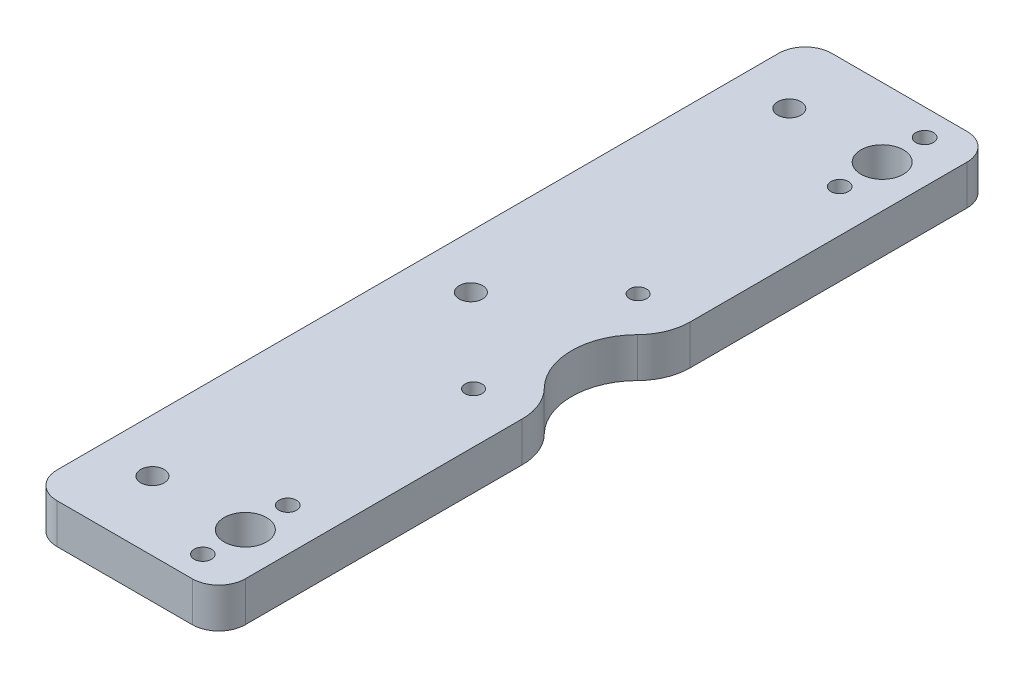
ISO-10303-21;
HEADER;
FILE_DESCRIPTION(('STEP AP214'),'2;1');
FILE_NAME('part.step','',(''),(''),'','','');
FILE_SCHEMA(('AUTOMOTIVE_DESIGN { 1 0 10303 214 1 1 1 1 }'));
ENDSEC;
DATA;
#1=APPLICATION_CONTEXT('core data for automotive mechanical design processes');
#2=APPLICATION_PROTOCOL_DEFINITION('international standard','automotive_design',2000,#1);
#3=PRODUCT_CONTEXT('',#1,'mechanical');
#4=PRODUCT('Part','Part','',(#3));
#5=PRODUCT_RELATED_PRODUCT_CATEGORY('part','',(#4));
#6=PRODUCT_DEFINITION_FORMATION('','',#4);
#7=PRODUCT_DEFINITION_CONTEXT('part definition',#1,'design');
#8=PRODUCT_DEFINITION('design','',#6,#7);
#9=PRODUCT_DEFINITION_SHAPE('','',#8);
#10=(LENGTH_UNIT() NAMED_UNIT(*) SI_UNIT(.MILLI.,.METRE.));
#11=(NAMED_UNIT(*) PLANE_ANGLE_UNIT() SI_UNIT($,.RADIAN.));
#12=(NAMED_UNIT(*) SI_UNIT($,.STERADIAN.) SOLID_ANGLE_UNIT());
#13=UNCERTAINTY_MEASURE_WITH_UNIT(LENGTH_MEASURE(1.E-05),#10,'distance_accuracy_value','');
#14=(GEOMETRIC_REPRESENTATION_CONTEXT(3) GLOBAL_UNCERTAINTY_ASSIGNED_CONTEXT((#13)) GLOBAL_UNIT_ASSIGNED_CONTEXT((#10,
#11,#12)) REPRESENTATION_CONTEXT('',''));
#15=CARTESIAN_POINT('',(0.,0.,0.));
#16=DIRECTION('',(0.,0.,1.));
#17=DIRECTION('',(1.,0.,0.));
#18=AXIS2_PLACEMENT_3D('',#15,#16,#17);
#19=CARTESIAN_POINT('',(3.,-3.75,68.));
#20=DIRECTION('',(0.,1.,0.));
#21=DIRECTION('',(0.,0.,1.));
#22=AXIS2_PLACEMENT_3D('',#19,#20,#21);
#23=CYLINDRICAL_SURFACE('',#22,5.);
#24=CARTESIAN_POINT('',(3.,3.75,68.));
#25=DIRECTION('',(0.,1.,0.));
#26=DIRECTION('',(0.,0.,1.));
#27=AXIS2_PLACEMENT_3D('',#24,#25,#26);
#28=CIRCLE('',#27,5.);
#29=CARTESIAN_POINT('',(3.,3.75,73.));
#30=VERTEX_POINT('',#29);
#31=CARTESIAN_POINT('',(8.,3.75,68.));
#32=VERTEX_POINT('',#31);
#33=EDGE_CURVE('E158',#30,#32,#28,.T.);
#34=ORIENTED_EDGE('',*,*,#33,.F.);
#35=DIRECTION('',(0.,1.,0.));
#36=VECTOR('',#35,1.);
#37=CARTESIAN_POINT('',(3.,-3.75,73.));
#38=LINE('',#37,#36);
#39=CARTESIAN_POINT('',(3.,-3.75,73.));
#40=VERTEX_POINT('',#39);
#41=EDGE_CURVE('E11',#40,#30,#38,.T.);
#42=ORIENTED_EDGE('',*,*,#41,.F.);
#43=CARTESIAN_POINT('',(3.,-3.75,68.));
#44=DIRECTION('',(0.,1.,0.));
#45=DIRECTION('',(0.,0.,1.));
#46=AXIS2_PLACEMENT_3D('',#43,#44,#45);
#47=CIRCLE('',#46,5.);
#48=CARTESIAN_POINT('',(8.,-3.75,68.));
#49=VERTEX_POINT('',#48);
#50=EDGE_CURVE('E191',#40,#49,#47,.T.);
#51=ORIENTED_EDGE('',*,*,#50,.T.);
#52=DIRECTION('',(0.,1.,0.));
#53=VECTOR('',#52,1.);
#54=CARTESIAN_POINT('',(8.,-3.75,68.));
#55=LINE('',#54,#53);
#56=EDGE_CURVE('E40',#49,#32,#55,.T.);
#57=ORIENTED_EDGE('',*,*,#56,.T.);
#58=EDGE_LOOP('',(#34,#42,#51,#57));
#59=FACE_BOUND('',#58,.T.);
#60=ADVANCED_FACE('F37',(#59),#23,.T.);
#61=CARTESIAN_POINT('',(-22.5,-3.75,73.));
#62=DIRECTION('',(0.,0.,1.));
#63=DIRECTION('',(1.,0.,0.));
#64=AXIS2_PLACEMENT_3D('',#61,#62,#63);
#65=PLANE('',#64);
#66=DIRECTION('',(1.,0.,0.));
#67=VECTOR('',#66,1.);
#68=CARTESIAN_POINT('',(-22.5,3.75,73.));
#69=LINE('',#68,#67);
#70=CARTESIAN_POINT('',(-22.5,3.75,73.));
#71=VERTEX_POINT('',#70);
#72=EDGE_CURVE('E189',#71,#30,#69,.T.);
#73=ORIENTED_EDGE('',*,*,#72,.F.);
#74=DIRECTION('',(0.,1.,0.));
#75=VECTOR('',#74,1.);
#76=CARTESIAN_POINT('',(-22.5,-3.75,73.));
#77=LINE('',#76,#75);
#78=CARTESIAN_POINT('',(-22.5,-3.75,73.));
#79=VERTEX_POINT('',#78);
#80=EDGE_CURVE('E46',#79,#71,#77,.T.);
#81=ORIENTED_EDGE('',*,*,#80,.F.);
#82=DIRECTION('',(1.,0.,0.));
#83=VECTOR('',#82,1.);
#84=CARTESIAN_POINT('',(-22.5,-3.75,73.));
#85=LINE('',#84,#83);
#86=EDGE_CURVE('E148',#79,#40,#85,.T.);
#87=ORIENTED_EDGE('',*,*,#86,.T.);
#88=ORIENTED_EDGE('',*,*,#41,.T.);
#89=EDGE_LOOP('',(#73,#81,#87,#88));
#90=FACE_BOUND('',#89,.T.);
#91=ADVANCED_FACE('F211',(#90),#65,.T.);
#92=CARTESIAN_POINT('',(-22.5,-3.75,68.));
#93=DIRECTION('',(0.,1.,0.));
#94=DIRECTION('',(0.,0.,1.));
#95=AXIS2_PLACEMENT_3D('',#92,#93,#94);
#96=CYLINDRICAL_SURFACE('',#95,5.);
#97=CARTESIAN_POINT('',(-22.5,3.75,68.));
#98=DIRECTION('',(0.,1.,0.));
#99=DIRECTION('',(0.,0.,1.));
#100=AXIS2_PLACEMENT_3D('',#97,#98,#99);
#101=CIRCLE('',#100,5.);
#102=CARTESIAN_POINT('',(-27.5,3.75,68.));
#103=VERTEX_POINT('',#102);
#104=EDGE_CURVE('E135',#103,#71,#101,.T.);
#105=ORIENTED_EDGE('',*,*,#104,.F.);
#106=DIRECTION('',(0.,1.,0.));
#107=VECTOR('',#106,1.);
#108=CARTESIAN_POINT('',(-27.5,-3.75,68.));
#109=LINE('',#108,#107);
#110=CARTESIAN_POINT('',(-27.5,-3.75,68.));
#111=VERTEX_POINT('',#110);
#112=EDGE_CURVE('E130',#111,#103,#109,.T.);
#113=ORIENTED_EDGE('',*,*,#112,.F.);
#114=CARTESIAN_POINT('',(-22.5,-3.75,68.));
#115=DIRECTION('',(0.,1.,0.));
#116=DIRECTION('',(0.,0.,1.));
#117=AXIS2_PLACEMENT_3D('',#114,#115,#116);
#118=CIRCLE('',#117,5.);
#119=EDGE_CURVE('E133',#111,#79,#118,.T.);
#120=ORIENTED_EDGE('',*,*,#119,.T.);
#121=ORIENTED_EDGE('',*,*,#80,.T.);
#122=EDGE_LOOP('',(#105,#113,#120,#121));
#123=FACE_BOUND('',#122,.T.);
#124=ADVANCED_FACE('F132',(#123),#96,.T.);
#125=CARTESIAN_POINT('',(-27.5,-3.75,-68.));
#126=DIRECTION('',(-1.,0.,0.));
#127=DIRECTION('',(0.,0.,1.));
#128=AXIS2_PLACEMENT_3D('',#125,#126,#127);
#129=PLANE('',#128);
#130=DIRECTION('',(0.,0.,1.));
#131=VECTOR('',#130,1.);
#132=CARTESIAN_POINT('',(-27.5,3.75,-68.));
#133=LINE('',#132,#131);
#134=CARTESIAN_POINT('',(-27.5,3.75,-68.));
#135=VERTEX_POINT('',#134);
#136=EDGE_CURVE('E186',#135,#103,#133,.T.);
#137=ORIENTED_EDGE('',*,*,#136,.F.);
#138=DIRECTION('',(0.,1.,0.));
#139=VECTOR('',#138,1.);
#140=CARTESIAN_POINT('',(-27.5,-3.75,-68.));
#141=LINE('',#140,#139);
#142=CARTESIAN_POINT('',(-27.5,-3.75,-68.));
#143=VERTEX_POINT('',#142);
#144=EDGE_CURVE('E140',#143,#135,#141,.T.);
#145=ORIENTED_EDGE('',*,*,#144,.F.);
#146=DIRECTION('',(0.,0.,1.));
#147=VECTOR('',#146,1.);
#148=CARTESIAN_POINT('',(-27.5,-3.75,-68.));
#149=LINE('',#148,#147);
#150=EDGE_CURVE('E146',#143,#111,#149,.T.);
#151=ORIENTED_EDGE('',*,*,#150,.T.);
#152=ORIENTED_EDGE('',*,*,#112,.T.);
#153=EDGE_LOOP('',(#137,#145,#151,#152));
#154=FACE_BOUND('',#153,.T.);
#155=ADVANCED_FACE('F150',(#154),#129,.T.);
#156=CARTESIAN_POINT('',(-22.5,-3.75,-68.));
#157=DIRECTION('',(0.,1.,0.));
#158=DIRECTION('',(0.,0.,1.));
#159=AXIS2_PLACEMENT_3D('',#156,#157,#158);
#160=CYLINDRICAL_SURFACE('',#159,5.);
#161=CARTESIAN_POINT('',(-22.5,3.75,-68.));
#162=DIRECTION('',(0.,1.,0.));
#163=DIRECTION('',(0.,0.,1.));
#164=AXIS2_PLACEMENT_3D('',#161,#162,#163);
#165=CIRCLE('',#164,5.);
#166=CARTESIAN_POINT('',(-22.5,3.75,-73.));
#167=VERTEX_POINT('',#166);
#168=EDGE_CURVE('E183',#167,#135,#165,.T.);
#169=ORIENTED_EDGE('',*,*,#168,.F.);
#170=DIRECTION('',(0.,1.,0.));
#171=VECTOR('',#170,1.);
#172=CARTESIAN_POINT('',(-22.5,-3.75,-73.));
#173=LINE('',#172,#171);
#174=CARTESIAN_POINT('',(-22.5,-3.75,-73.));
#175=VERTEX_POINT('',#174);
#176=EDGE_CURVE('E195',#175,#167,#173,.T.);
#177=ORIENTED_EDGE('',*,*,#176,.F.);
#178=CARTESIAN_POINT('',(-22.5,-3.75,-68.));
#179=DIRECTION('',(0.,1.,0.));
#180=DIRECTION('',(0.,0.,1.));
#181=AXIS2_PLACEMENT_3D('',#178,#179,#180);
#182=CIRCLE('',#181,5.);
#183=EDGE_CURVE('E151',#175,#143,#182,.T.);
#184=ORIENTED_EDGE('',*,*,#183,.T.);
#185=ORIENTED_EDGE('',*,*,#144,.T.);
#186=EDGE_LOOP('',(#169,#177,#184,#185));
#187=FACE_BOUND('',#186,.T.);
#188=ADVANCED_FACE('F224',(#187),#160,.T.);
#189=CARTESIAN_POINT('',(3.,-3.75,-73.));
#190=DIRECTION('',(0.,0.,-1.));
#191=DIRECTION('',(-1.,0.,0.));
#192=AXIS2_PLACEMENT_3D('',#189,#190,#191);
#193=PLANE('',#192);
#194=DIRECTION('',(-1.,0.,0.));
#195=VECTOR('',#194,1.);
#196=CARTESIAN_POINT('',(3.,3.75,-73.));
#197=LINE('',#196,#195);
#198=CARTESIAN_POINT('',(3.,3.75,-73.));
#199=VERTEX_POINT('',#198);
#200=EDGE_CURVE('E180',#199,#167,#197,.T.);
#201=ORIENTED_EDGE('',*,*,#200,.F.);
#202=DIRECTION('',(0.,1.,0.));
#203=VECTOR('',#202,1.);
#204=CARTESIAN_POINT('',(3.,-3.75,-73.));
#205=LINE('',#204,#203);
#206=CARTESIAN_POINT('',(3.,-3.75,-73.));
#207=VERTEX_POINT('',#206);
#208=EDGE_CURVE('E197',#207,#199,#205,.T.);
#209=ORIENTED_EDGE('',*,*,#208,.F.);
#210=DIRECTION('',(-1.,0.,0.));
#211=VECTOR('',#210,1.);
#212=CARTESIAN_POINT('',(3.,-3.75,-73.));
#213=LINE('',#212,#211);
#214=EDGE_CURVE('E153',#207,#175,#213,.T.);
#215=ORIENTED_EDGE('',*,*,#214,.T.);
#216=ORIENTED_EDGE('',*,*,#176,.T.);
#217=EDGE_LOOP('',(#201,#209,#215,#216));
#218=FACE_BOUND('',#217,.T.);
#219=ADVANCED_FACE('F227',(#218),#193,.T.);
#220=CARTESIAN_POINT('',(3.,-3.75,-68.));
#221=DIRECTION('',(0.,1.,0.));
#222=DIRECTION('',(0.,0.,1.));
#223=AXIS2_PLACEMENT_3D('',#220,#221,#222);
#224=CYLINDRICAL_SURFACE('',#223,5.);
#225=CARTESIAN_POINT('',(3.,3.75,-68.));
#226=DIRECTION('',(0.,1.,0.));
#227=DIRECTION('',(0.,0.,1.));
#228=AXIS2_PLACEMENT_3D('',#225,#226,#227);
#229=CIRCLE('',#228,5.);
#230=CARTESIAN_POINT('',(8.,3.75,-68.));
#231=VERTEX_POINT('',#230);
#232=EDGE_CURVE('E177',#231,#199,#229,.T.);
#233=ORIENTED_EDGE('',*,*,#232,.F.);
#234=DIRECTION('',(0.,1.,0.));
#235=VECTOR('',#234,1.);
#236=CARTESIAN_POINT('',(8.,-3.75,-68.));
#237=LINE('',#236,#235);
#238=CARTESIAN_POINT('',(8.,-3.75,-68.));
#239=VERTEX_POINT('',#238);
#240=EDGE_CURVE('E199',#239,#231,#237,.T.);
#241=ORIENTED_EDGE('',*,*,#240,.F.);
#242=CARTESIAN_POINT('',(3.,-3.75,-68.));
#243=DIRECTION('',(0.,1.,0.));
#244=DIRECTION('',(0.,0.,1.));
#245=AXIS2_PLACEMENT_3D('',#242,#243,#244);
#246=CIRCLE('',#245,5.);
#247=EDGE_CURVE('E391',#239,#207,#246,.T.);
#248=ORIENTED_EDGE('',*,*,#247,.T.);
#249=ORIENTED_EDGE('',*,*,#208,.T.);
#250=EDGE_LOOP('',(#233,#241,#248,#249));
#251=FACE_BOUND('',#250,.T.);
#252=ADVANCED_FACE('F231',(#251),#224,.T.);
#253=CARTESIAN_POINT('',(8.,-3.75,-15.8192920195564));
#254=DIRECTION('',(1.,0.,0.));
#255=DIRECTION('',(0.,0.,-1.));
#256=AXIS2_PLACEMENT_3D('',#253,#254,#255);
#257=PLANE('',#256);
#258=DIRECTION('',(0.,0.,-1.));
#259=VECTOR('',#258,1.);
#260=CARTESIAN_POINT('',(8.,3.75,-15.8192920195564));
#261=LINE('',#260,#259);
#262=CARTESIAN_POINT('',(8.00000000000001,3.75,-15.8192920195564));
#263=VERTEX_POINT('',#262);
#264=EDGE_CURVE('E174',#263,#231,#261,.T.);
#265=ORIENTED_EDGE('',*,*,#264,.F.);
#266=DIRECTION('',(0.,1.,0.));
#267=VECTOR('',#266,1.);
#268=CARTESIAN_POINT('',(8.00000000000001,-3.75,-15.8192920195564));
#269=LINE('',#268,#267);
#270=CARTESIAN_POINT('',(8.00000000000001,-3.75,-15.8192920195564));
#271=VERTEX_POINT('',#270);
#272=EDGE_CURVE('E201',#271,#263,#269,.T.);
#273=ORIENTED_EDGE('',*,*,#272,.F.);
#274=DIRECTION('',(0.,0.,-1.));
#275=VECTOR('',#274,1.);
#276=CARTESIAN_POINT('',(8.,-3.75,-15.8192920195564));
#277=LINE('',#276,#275);
#278=EDGE_CURVE('E388',#271,#239,#277,.T.);
#279=ORIENTED_EDGE('',*,*,#278,.T.);
#280=ORIENTED_EDGE('',*,*,#240,.T.);
#281=EDGE_LOOP('',(#265,#273,#279,#280));
#282=FACE_BOUND('',#281,.T.);
#283=ADVANCED_FACE('F235',(#282),#257,.T.);
#284=CARTESIAN_POINT('',(-2.,-3.75,-15.8192920195564));
#285=DIRECTION('',(0.,1.,0.));
#286=DIRECTION('',(0.,0.,1.));
#287=AXIS2_PLACEMENT_3D('',#284,#285,#286);
#288=CYLINDRICAL_SURFACE('',#287,10.);
#289=CARTESIAN_POINT('',(-2.,3.75,-15.8192920195564));
#290=DIRECTION('',(0.,1.,0.));
#291=DIRECTION('',(0.,0.,1.));
#292=AXIS2_PLACEMENT_3D('',#289,#290,#291);
#293=CIRCLE('',#292,10.);
#294=CARTESIAN_POINT('',(5.11111111111112,3.75,-8.7884955664202));
#295=VERTEX_POINT('',#294);
#296=EDGE_CURVE('E171',#295,#263,#293,.T.);
#297=ORIENTED_EDGE('',*,*,#296,.F.);
#298=DIRECTION('',(0.,1.,0.));
#299=VECTOR('',#298,1.);
#300=CARTESIAN_POINT('',(5.11111111111112,-3.75,-8.7884955664202));
#301=LINE('',#300,#299);
#302=CARTESIAN_POINT('',(5.11111111111112,-3.75,-8.7884955664202));
#303=VERTEX_POINT('',#302);
#304=EDGE_CURVE('E203',#303,#295,#301,.T.);
#305=ORIENTED_EDGE('',*,*,#304,.F.);
#306=CARTESIAN_POINT('',(-2.,-3.75,-15.8192920195564));
#307=DIRECTION('',(0.,1.,0.));
#308=DIRECTION('',(0.,0.,1.));
#309=AXIS2_PLACEMENT_3D('',#306,#307,#308);
#310=CIRCLE('',#309,10.);
#311=EDGE_CURVE('E385',#303,#271,#310,.T.);
#312=ORIENTED_EDGE('',*,*,#311,.T.);
#313=ORIENTED_EDGE('',*,*,#272,.T.);
#314=EDGE_LOOP('',(#297,#305,#312,#313));
#315=FACE_BOUND('',#314,.T.);
#316=ADVANCED_FACE('F239',(#315),#288,.T.);
#317=CARTESIAN_POINT('',(14.,-3.75,0.));
#318=DIRECTION('',(0.,1.,0.));
#319=DIRECTION('',(0.,0.,1.));
#320=AXIS2_PLACEMENT_3D('',#317,#318,#319);
#321=CYLINDRICAL_SURFACE('',#320,12.5);
#322=CARTESIAN_POINT('',(14.,3.75,0.));
#323=DIRECTION('',(0.,-1.,0.));
#324=DIRECTION('',(0.,0.,-1.));
#325=AXIS2_PLACEMENT_3D('',#322,#323,#324);
#326=CIRCLE('',#325,12.5);
#327=CARTESIAN_POINT('',(5.11111111111111,3.75,8.78849556642022));
#328=VERTEX_POINT('',#327);
#329=EDGE_CURVE('E168',#328,#295,#326,.T.);
#330=ORIENTED_EDGE('',*,*,#329,.F.);
#331=DIRECTION('',(0.,1.,0.));
#332=VECTOR('',#331,1.);
#333=CARTESIAN_POINT('',(5.11111111111111,-3.75,8.78849556642022));
#334=LINE('',#333,#332);
#335=CARTESIAN_POINT('',(5.11111111111111,-3.75,8.78849556642022));
#336=VERTEX_POINT('',#335);
#337=EDGE_CURVE('E205',#336,#328,#334,.T.);
#338=ORIENTED_EDGE('',*,*,#337,.F.);
#339=CARTESIAN_POINT('',(14.,-3.75,0.));
#340=DIRECTION('',(0.,-1.,0.));
#341=DIRECTION('',(0.,0.,-1.));
#342=AXIS2_PLACEMENT_3D('',#339,#340,#341);
#343=CIRCLE('',#342,12.5);
#344=EDGE_CURVE('E382',#336,#303,#343,.T.);
#345=ORIENTED_EDGE('',*,*,#344,.T.);
#346=ORIENTED_EDGE('',*,*,#304,.T.);
#347=EDGE_LOOP('',(#330,#338,#345,#346));
#348=FACE_BOUND('',#347,.T.);
#349=ADVANCED_FACE('F243',(#348),#321,.F.);
#350=CARTESIAN_POINT('',(-2.,-3.75,15.8192920195564));
#351=DIRECTION('',(0.,1.,0.));
#352=DIRECTION('',(0.,0.,1.));
#353=AXIS2_PLACEMENT_3D('',#350,#351,#352);
#354=CYLINDRICAL_SURFACE('',#353,10.);
#355=CARTESIAN_POINT('',(-2.,3.75,15.8192920195564));
#356=DIRECTION('',(0.,1.,0.));
#357=DIRECTION('',(0.,0.,1.));
#358=AXIS2_PLACEMENT_3D('',#355,#356,#357);
#359=CIRCLE('',#358,10.);
#360=CARTESIAN_POINT('',(8.,3.75,15.8192920195564));
#361=VERTEX_POINT('',#360);
#362=EDGE_CURVE('E165',#361,#328,#359,.T.);
#363=ORIENTED_EDGE('',*,*,#362,.F.);
#364=DIRECTION('',(0.,1.,0.));
#365=VECTOR('',#364,1.);
#366=CARTESIAN_POINT('',(8.,-3.75,15.8192920195564));
#367=LINE('',#366,#365);
#368=CARTESIAN_POINT('',(8.,-3.75,15.8192920195564));
#369=VERTEX_POINT('',#368);
#370=EDGE_CURVE('E206',#369,#361,#367,.T.);
#371=ORIENTED_EDGE('',*,*,#370,.F.);
#372=CARTESIAN_POINT('',(-2.,-3.75,15.8192920195564));
#373=DIRECTION('',(0.,1.,0.));
#374=DIRECTION('',(0.,0.,1.));
#375=AXIS2_PLACEMENT_3D('',#372,#373,#374);
#376=CIRCLE('',#375,10.);
#377=EDGE_CURVE('E379',#369,#336,#376,.T.);
#378=ORIENTED_EDGE('',*,*,#377,.T.);
#379=ORIENTED_EDGE('',*,*,#337,.T.);
#380=EDGE_LOOP('',(#363,#371,#378,#379));
#381=FACE_BOUND('',#380,.T.);
#382=ADVANCED_FACE('F247',(#381),#354,.T.);
#383=CARTESIAN_POINT('',(8.,-3.75,68.));
#384=DIRECTION('',(1.,0.,0.));
#385=DIRECTION('',(0.,0.,-1.));
#386=AXIS2_PLACEMENT_3D('',#383,#384,#385);
#387=PLANE('',#386);
#388=DIRECTION('',(0.,0.,-1.));
#389=VECTOR('',#388,1.);
#390=CARTESIAN_POINT('',(8.,3.75,68.));
#391=LINE('',#390,#389);
#392=EDGE_CURVE('E161',#32,#361,#391,.T.);
#393=ORIENTED_EDGE('',*,*,#392,.F.);
#394=ORIENTED_EDGE('',*,*,#56,.F.);
#395=DIRECTION('',(0.,0.,-1.));
#396=VECTOR('',#395,1.);
#397=CARTESIAN_POINT('',(8.,-3.75,68.));
#398=LINE('',#397,#396);
#399=EDGE_CURVE('E377',#49,#369,#398,.T.);
#400=ORIENTED_EDGE('',*,*,#399,.T.);
#401=ORIENTED_EDGE('',*,*,#370,.T.);
#402=EDGE_LOOP('',(#393,#394,#400,#401));
#403=FACE_BOUND('',#402,.T.);
#404=ADVANCED_FACE('F208',(#403),#387,.T.);
#405=CARTESIAN_POINT('',(3.,-3.75,68.));
#406=DIRECTION('',(0.,1.,0.));
#407=DIRECTION('',(0.,0.,1.));
#408=AXIS2_PLACEMENT_3D('',#405,#406,#407);
#409=PLANE('',#408);
#410=CARTESIAN_POINT('',(-17.5,-3.75,60.));
#411=DIRECTION('',(0.,1.,0.));
#412=DIRECTION('',(0.,0.,-1.));
#413=AXIS2_PLACEMENT_3D('',#410,#411,#412);
#414=CIRCLE('',#413,2.2);
#415=CARTESIAN_POINT('',(-17.5,-3.75,57.8));
#416=VERTEX_POINT('',#415);
#417=EDGE_CURVE('E310',#416,#416,#414,.T.);
#418=ORIENTED_EDGE('',*,*,#417,.T.);
#419=EDGE_LOOP('',(#418));
#420=FACE_BOUND('',#419,.T.);
#421=CARTESIAN_POINT('',(-17.5,-3.75,-60.));
#422=DIRECTION('',(0.,1.,0.));
#423=DIRECTION('',(0.,0.,-1.));
#424=AXIS2_PLACEMENT_3D('',#421,#422,#423);
#425=CIRCLE('',#424,2.2);
#426=CARTESIAN_POINT('',(-17.5,-3.75,-62.2));
#427=VERTEX_POINT('',#426);
#428=EDGE_CURVE('E318',#427,#427,#425,.T.);
#429=ORIENTED_EDGE('',*,*,#428,.T.);
#430=EDGE_LOOP('',(#429));
#431=FACE_BOUND('',#430,.T.);
#432=CARTESIAN_POINT('',(0.,-3.75,-60.));
#433=DIRECTION('',(0.,1.,0.));
#434=DIRECTION('',(0.,0.,-1.));
#435=AXIS2_PLACEMENT_3D('',#432,#433,#434);
#436=CIRCLE('',#435,4.);
#437=CARTESIAN_POINT('',(0.,-3.75,-64.));
#438=VERTEX_POINT('',#437);
#439=EDGE_CURVE('E324',#438,#438,#436,.T.);
#440=ORIENTED_EDGE('',*,*,#439,.T.);
#441=EDGE_LOOP('',(#440));
#442=FACE_BOUND('',#441,.T.);
#443=CARTESIAN_POINT('',(0.,-3.75,60.));
#444=DIRECTION('',(0.,1.,0.));
#445=DIRECTION('',(0.,0.,-1.));
#446=AXIS2_PLACEMENT_3D('',#443,#444,#445);
#447=CIRCLE('',#446,4.);
#448=CARTESIAN_POINT('',(0.,-3.75,56.));
#449=VERTEX_POINT('',#448);
#450=EDGE_CURVE('E330',#449,#449,#447,.T.);
#451=ORIENTED_EDGE('',*,*,#450,.T.);
#452=EDGE_LOOP('',(#451));
#453=FACE_BOUND('',#452,.T.);
#454=CARTESIAN_POINT('',(-17.5,-3.75,0.));
#455=DIRECTION('',(0.,1.,0.));
#456=DIRECTION('',(0.,0.,-1.));
#457=AXIS2_PLACEMENT_3D('',#454,#455,#456);
#458=CIRCLE('',#457,2.2);
#459=CARTESIAN_POINT('',(-17.5,-3.75,-2.2));
#460=VERTEX_POINT('',#459);
#461=EDGE_CURVE('E336',#460,#460,#458,.T.);
#462=ORIENTED_EDGE('',*,*,#461,.T.);
#463=EDGE_LOOP('',(#462));
#464=FACE_BOUND('',#463,.T.);
#465=CARTESIAN_POINT('',(-1.5,-3.75,15.5));
#466=DIRECTION('',(0.,1.,0.));
#467=DIRECTION('',(0.,0.,-1.));
#468=AXIS2_PLACEMENT_3D('',#465,#466,#467);
#469=CIRCLE('',#468,1.6);
#470=CARTESIAN_POINT('',(-1.5,-3.75,13.9));
#471=VERTEX_POINT('',#470);
#472=EDGE_CURVE('E342',#471,#471,#469,.T.);
#473=ORIENTED_EDGE('',*,*,#472,.T.);
#474=EDGE_LOOP('',(#473));
#475=FACE_BOUND('',#474,.T.);
#476=CARTESIAN_POINT('',(-1.5,-3.75,-15.5));
#477=DIRECTION('',(0.,1.,0.));
#478=DIRECTION('',(0.,0.,-1.));
#479=AXIS2_PLACEMENT_3D('',#476,#477,#478);
#480=CIRCLE('',#479,1.6);
#481=CARTESIAN_POINT('',(-1.5,-3.75,-17.1));
#482=VERTEX_POINT('',#481);
#483=EDGE_CURVE('E348',#482,#482,#480,.T.);
#484=ORIENTED_EDGE('',*,*,#483,.T.);
#485=EDGE_LOOP('',(#484));
#486=FACE_BOUND('',#485,.T.);
#487=CARTESIAN_POINT('',(0.,-3.75,-52.));
#488=DIRECTION('',(0.,1.,0.));
#489=DIRECTION('',(0.,0.,-1.));
#490=AXIS2_PLACEMENT_3D('',#487,#488,#489);
#491=CIRCLE('',#490,1.65);
#492=CARTESIAN_POINT('',(0.,-3.75,-53.65));
#493=VERTEX_POINT('',#492);
#494=EDGE_CURVE('E354',#493,#493,#491,.T.);
#495=ORIENTED_EDGE('',*,*,#494,.T.);
#496=EDGE_LOOP('',(#495));
#497=FACE_BOUND('',#496,.T.);
#498=CARTESIAN_POINT('',(0.,-3.75,-68.));
#499=DIRECTION('',(0.,1.,0.));
#500=DIRECTION('',(0.,0.,-1.));
#501=AXIS2_PLACEMENT_3D('',#498,#499,#500);
#502=CIRCLE('',#501,1.65);
#503=CARTESIAN_POINT('',(0.,-3.75,-69.65));
#504=VERTEX_POINT('',#503);
#505=EDGE_CURVE('E360',#504,#504,#502,.T.);
#506=ORIENTED_EDGE('',*,*,#505,.T.);
#507=EDGE_LOOP('',(#506));
#508=FACE_BOUND('',#507,.T.);
#509=CARTESIAN_POINT('',(0.,-3.75,52.));
#510=DIRECTION('',(0.,1.,0.));
#511=DIRECTION('',(0.,0.,-1.));
#512=AXIS2_PLACEMENT_3D('',#509,#510,#511);
#513=CIRCLE('',#512,1.65);
#514=CARTESIAN_POINT('',(0.,-3.75,50.35));
#515=VERTEX_POINT('',#514);
#516=EDGE_CURVE('E366',#515,#515,#513,.T.);
#517=ORIENTED_EDGE('',*,*,#516,.T.);
#518=EDGE_LOOP('',(#517));
#519=FACE_BOUND('',#518,.T.);
#520=CARTESIAN_POINT('',(0.,-3.75,68.));
#521=DIRECTION('',(0.,1.,0.));
#522=DIRECTION('',(0.,0.,-1.));
#523=AXIS2_PLACEMENT_3D('',#520,#521,#522);
#524=CIRCLE('',#523,1.65);
#525=CARTESIAN_POINT('',(0.,-3.75,66.35));
#526=VERTEX_POINT('',#525);
#527=EDGE_CURVE('E162',#526,#526,#524,.T.);
#528=ORIENTED_EDGE('',*,*,#527,.T.);
#529=EDGE_LOOP('',(#528));
#530=FACE_BOUND('',#529,.T.);
#531=ORIENTED_EDGE('',*,*,#50,.F.);
#532=ORIENTED_EDGE('',*,*,#86,.F.);
#533=ORIENTED_EDGE('',*,*,#119,.F.);
#534=ORIENTED_EDGE('',*,*,#150,.F.);
#535=ORIENTED_EDGE('',*,*,#183,.F.);
#536=ORIENTED_EDGE('',*,*,#214,.F.);
#537=ORIENTED_EDGE('',*,*,#247,.F.);
#538=ORIENTED_EDGE('',*,*,#278,.F.);
#539=ORIENTED_EDGE('',*,*,#311,.F.);
#540=ORIENTED_EDGE('',*,*,#344,.F.);
#541=ORIENTED_EDGE('',*,*,#377,.F.);
#542=ORIENTED_EDGE('',*,*,#399,.F.);
#543=EDGE_LOOP('',(#531,#532,#533,#534,#535,#536,#537,#538,#539,#540,#541,#542));
#544=FACE_BOUND('',#543,.T.);
#545=ADVANCED_FACE('F144',(#420,#431,#442,#453,#464,#475,#486,#497,#508,#519,#530,#544),#409,.F.);
#546=CARTESIAN_POINT('',(3.,3.75,68.));
#547=DIRECTION('',(0.,1.,0.));
#548=DIRECTION('',(0.,0.,1.));
#549=AXIS2_PLACEMENT_3D('',#546,#547,#548);
#550=PLANE('',#549);
#551=CARTESIAN_POINT('',(-17.5,3.75,60.));
#552=DIRECTION('',(0.,1.,0.));
#553=DIRECTION('',(0.,0.,-1.));
#554=AXIS2_PLACEMENT_3D('',#551,#552,#553);
#555=CIRCLE('',#554,2.2);
#556=CARTESIAN_POINT('',(-17.5,3.75,57.8));
#557=VERTEX_POINT('',#556);
#558=EDGE_CURVE('E313',#557,#557,#555,.T.);
#559=ORIENTED_EDGE('',*,*,#558,.F.);
#560=EDGE_LOOP('',(#559));
#561=FACE_BOUND('',#560,.T.);
#562=CARTESIAN_POINT('',(-17.5,3.75,-60.));
#563=DIRECTION('',(0.,1.,0.));
#564=DIRECTION('',(0.,0.,-1.));
#565=AXIS2_PLACEMENT_3D('',#562,#563,#564);
#566=CIRCLE('',#565,2.2);
#567=CARTESIAN_POINT('',(-17.5,3.75,-62.2));
#568=VERTEX_POINT('',#567);
#569=EDGE_CURVE('E315',#568,#568,#566,.T.);
#570=ORIENTED_EDGE('',*,*,#569,.F.);
#571=EDGE_LOOP('',(#570));
#572=FACE_BOUND('',#571,.T.);
#573=CARTESIAN_POINT('',(0.,3.75,-60.));
#574=DIRECTION('',(0.,1.,0.));
#575=DIRECTION('',(0.,0.,-1.));
#576=AXIS2_PLACEMENT_3D('',#573,#574,#575);
#577=CIRCLE('',#576,4.);
#578=CARTESIAN_POINT('',(0.,3.75,-64.));
#579=VERTEX_POINT('',#578);
#580=EDGE_CURVE('E321',#579,#579,#577,.T.);
#581=ORIENTED_EDGE('',*,*,#580,.F.);
#582=EDGE_LOOP('',(#581));
#583=FACE_BOUND('',#582,.T.);
#584=CARTESIAN_POINT('',(0.,3.75,60.));
#585=DIRECTION('',(0.,1.,0.));
#586=DIRECTION('',(0.,0.,-1.));
#587=AXIS2_PLACEMENT_3D('',#584,#585,#586);
#588=CIRCLE('',#587,4.);
#589=CARTESIAN_POINT('',(0.,3.75,56.));
#590=VERTEX_POINT('',#589);
#591=EDGE_CURVE('E327',#590,#590,#588,.T.);
#592=ORIENTED_EDGE('',*,*,#591,.F.);
#593=EDGE_LOOP('',(#592));
#594=FACE_BOUND('',#593,.T.);
#595=CARTESIAN_POINT('',(-17.5,3.75,0.));
#596=DIRECTION('',(0.,1.,0.));
#597=DIRECTION('',(0.,0.,-1.));
#598=AXIS2_PLACEMENT_3D('',#595,#596,#597);
#599=CIRCLE('',#598,2.2);
#600=CARTESIAN_POINT('',(-17.5,3.75,-2.2));
#601=VERTEX_POINT('',#600);
#602=EDGE_CURVE('E333',#601,#601,#599,.T.);
#603=ORIENTED_EDGE('',*,*,#602,.F.);
#604=EDGE_LOOP('',(#603));
#605=FACE_BOUND('',#604,.T.);
#606=CARTESIAN_POINT('',(-1.5,3.75,15.5));
#607=DIRECTION('',(0.,1.,0.));
#608=DIRECTION('',(0.,0.,-1.));
#609=AXIS2_PLACEMENT_3D('',#606,#607,#608);
#610=CIRCLE('',#609,1.6);
#611=CARTESIAN_POINT('',(-1.5,3.75,13.9));
#612=VERTEX_POINT('',#611);
#613=EDGE_CURVE('E339',#612,#612,#610,.T.);
#614=ORIENTED_EDGE('',*,*,#613,.F.);
#615=EDGE_LOOP('',(#614));
#616=FACE_BOUND('',#615,.T.);
#617=CARTESIAN_POINT('',(-1.5,3.75,-15.5));
#618=DIRECTION('',(0.,1.,0.));
#619=DIRECTION('',(0.,0.,-1.));
#620=AXIS2_PLACEMENT_3D('',#617,#618,#619);
#621=CIRCLE('',#620,1.6);
#622=CARTESIAN_POINT('',(-1.5,3.75,-17.1));
#623=VERTEX_POINT('',#622);
#624=EDGE_CURVE('E345',#623,#623,#621,.T.);
#625=ORIENTED_EDGE('',*,*,#624,.F.);
#626=EDGE_LOOP('',(#625));
#627=FACE_BOUND('',#626,.T.);
#628=CARTESIAN_POINT('',(0.,3.75,-52.));
#629=DIRECTION('',(0.,1.,0.));
#630=DIRECTION('',(0.,0.,-1.));
#631=AXIS2_PLACEMENT_3D('',#628,#629,#630);
#632=CIRCLE('',#631,1.65);
#633=CARTESIAN_POINT('',(0.,3.75,-53.65));
#634=VERTEX_POINT('',#633);
#635=EDGE_CURVE('E351',#634,#634,#632,.T.);
#636=ORIENTED_EDGE('',*,*,#635,.F.);
#637=EDGE_LOOP('',(#636));
#638=FACE_BOUND('',#637,.T.);
#639=CARTESIAN_POINT('',(0.,3.75,-68.));
#640=DIRECTION('',(0.,1.,0.));
#641=DIRECTION('',(0.,0.,-1.));
#642=AXIS2_PLACEMENT_3D('',#639,#640,#641);
#643=CIRCLE('',#642,1.65);
#644=CARTESIAN_POINT('',(0.,3.75,-69.65));
#645=VERTEX_POINT('',#644);
#646=EDGE_CURVE('E357',#645,#645,#643,.T.);
#647=ORIENTED_EDGE('',*,*,#646,.F.);
#648=EDGE_LOOP('',(#647));
#649=FACE_BOUND('',#648,.T.);
#650=CARTESIAN_POINT('',(0.,3.75,52.));
#651=DIRECTION('',(0.,1.,0.));
#652=DIRECTION('',(0.,0.,-1.));
#653=AXIS2_PLACEMENT_3D('',#650,#651,#652);
#654=CIRCLE('',#653,1.65);
#655=CARTESIAN_POINT('',(0.,3.75,50.35));
#656=VERTEX_POINT('',#655);
#657=EDGE_CURVE('E363',#656,#656,#654,.T.);
#658=ORIENTED_EDGE('',*,*,#657,.F.);
#659=EDGE_LOOP('',(#658));
#660=FACE_BOUND('',#659,.T.);
#661=CARTESIAN_POINT('',(0.,3.75,68.));
#662=DIRECTION('',(0.,1.,0.));
#663=DIRECTION('',(0.,0.,-1.));
#664=AXIS2_PLACEMENT_3D('',#661,#662,#663);
#665=CIRCLE('',#664,1.65);
#666=CARTESIAN_POINT('',(0.,3.75,66.35));
#667=VERTEX_POINT('',#666);
#668=EDGE_CURVE('E369',#667,#667,#665,.T.);
#669=ORIENTED_EDGE('',*,*,#668,.F.);
#670=EDGE_LOOP('',(#669));
#671=FACE_BOUND('',#670,.T.);
#672=ORIENTED_EDGE('',*,*,#33,.T.);
#673=ORIENTED_EDGE('',*,*,#392,.T.);
#674=ORIENTED_EDGE('',*,*,#362,.T.);
#675=ORIENTED_EDGE('',*,*,#329,.T.);
#676=ORIENTED_EDGE('',*,*,#296,.T.);
#677=ORIENTED_EDGE('',*,*,#264,.T.);
#678=ORIENTED_EDGE('',*,*,#232,.T.);
#679=ORIENTED_EDGE('',*,*,#200,.T.);
#680=ORIENTED_EDGE('',*,*,#168,.T.);
#681=ORIENTED_EDGE('',*,*,#136,.T.);
#682=ORIENTED_EDGE('',*,*,#104,.T.);
#683=ORIENTED_EDGE('',*,*,#72,.T.);
#684=EDGE_LOOP('',(#672,#673,#674,#675,#676,#677,#678,#679,#680,#681,#682,#683));
#685=FACE_BOUND('',#684,.T.);
#686=ADVANCED_FACE('F210',(#561,#572,#583,#594,#605,#616,#627,#638,#649,#660,#671,#685),#550,.T.);
#687=CARTESIAN_POINT('',(0.,-3.75,68.));
#688=DIRECTION('',(0.,1.,0.));
#689=DIRECTION('',(0.,0.,1.));
#690=AXIS2_PLACEMENT_3D('',#687,#688,#689);
#691=CYLINDRICAL_SURFACE('',#690,1.65);
#692=ORIENTED_EDGE('',*,*,#527,.F.);
#693=EDGE_LOOP('',(#692));
#694=FACE_BOUND('',#693,.T.);
#695=ORIENTED_EDGE('',*,*,#668,.T.);
#696=EDGE_LOOP('',(#695));
#697=FACE_BOUND('',#696,.T.);
#698=ADVANCED_FACE('F259',(#694,#697),#691,.F.);
#699=CARTESIAN_POINT('',(0.,-3.75,52.));
#700=DIRECTION('',(0.,1.,0.));
#701=DIRECTION('',(0.,0.,1.));
#702=AXIS2_PLACEMENT_3D('',#699,#700,#701);
#703=CYLINDRICAL_SURFACE('',#702,1.65);
#704=ORIENTED_EDGE('',*,*,#516,.F.);
#705=EDGE_LOOP('',(#704));
#706=FACE_BOUND('',#705,.T.);
#707=ORIENTED_EDGE('',*,*,#657,.T.);
#708=EDGE_LOOP('',(#707));
#709=FACE_BOUND('',#708,.T.);
#710=ADVANCED_FACE('F266',(#706,#709),#703,.F.);
#711=CARTESIAN_POINT('',(0.,-3.75,-68.));
#712=DIRECTION('',(0.,1.,0.));
#713=DIRECTION('',(0.,0.,1.));
#714=AXIS2_PLACEMENT_3D('',#711,#712,#713);
#715=CYLINDRICAL_SURFACE('',#714,1.65);
#716=ORIENTED_EDGE('',*,*,#505,.F.);
#717=EDGE_LOOP('',(#716));
#718=FACE_BOUND('',#717,.T.);
#719=ORIENTED_EDGE('',*,*,#646,.T.);
#720=EDGE_LOOP('',(#719));
#721=FACE_BOUND('',#720,.T.);
#722=ADVANCED_FACE('F270',(#718,#721),#715,.F.);
#723=CARTESIAN_POINT('',(0.,-3.75,-52.));
#724=DIRECTION('',(0.,1.,0.));
#725=DIRECTION('',(0.,0.,1.));
#726=AXIS2_PLACEMENT_3D('',#723,#724,#725);
#727=CYLINDRICAL_SURFACE('',#726,1.65);
#728=ORIENTED_EDGE('',*,*,#494,.F.);
#729=EDGE_LOOP('',(#728));
#730=FACE_BOUND('',#729,.T.);
#731=ORIENTED_EDGE('',*,*,#635,.T.);
#732=EDGE_LOOP('',(#731));
#733=FACE_BOUND('',#732,.T.);
#734=ADVANCED_FACE('F274',(#730,#733),#727,.F.);
#735=CARTESIAN_POINT('',(-1.5,-3.75,-15.5));
#736=DIRECTION('',(0.,1.,0.));
#737=DIRECTION('',(0.,0.,1.));
#738=AXIS2_PLACEMENT_3D('',#735,#736,#737);
#739=CYLINDRICAL_SURFACE('',#738,1.6);
#740=ORIENTED_EDGE('',*,*,#483,.F.);
#741=EDGE_LOOP('',(#740));
#742=FACE_BOUND('',#741,.T.);
#743=ORIENTED_EDGE('',*,*,#624,.T.);
#744=EDGE_LOOP('',(#743));
#745=FACE_BOUND('',#744,.T.);
#746=ADVANCED_FACE('F278',(#742,#745),#739,.F.);
#747=CARTESIAN_POINT('',(-1.5,-3.75,15.5));
#748=DIRECTION('',(0.,1.,0.));
#749=DIRECTION('',(0.,0.,1.));
#750=AXIS2_PLACEMENT_3D('',#747,#748,#749);
#751=CYLINDRICAL_SURFACE('',#750,1.6);
#752=ORIENTED_EDGE('',*,*,#472,.F.);
#753=EDGE_LOOP('',(#752));
#754=FACE_BOUND('',#753,.T.);
#755=ORIENTED_EDGE('',*,*,#613,.T.);
#756=EDGE_LOOP('',(#755));
#757=FACE_BOUND('',#756,.T.);
#758=ADVANCED_FACE('F282',(#754,#757),#751,.F.);
#759=CARTESIAN_POINT('',(-17.5,-3.75,0.));
#760=DIRECTION('',(0.,1.,0.));
#761=DIRECTION('',(0.,0.,1.));
#762=AXIS2_PLACEMENT_3D('',#759,#760,#761);
#763=CYLINDRICAL_SURFACE('',#762,2.2);
#764=ORIENTED_EDGE('',*,*,#461,.F.);
#765=EDGE_LOOP('',(#764));
#766=FACE_BOUND('',#765,.T.);
#767=ORIENTED_EDGE('',*,*,#602,.T.);
#768=EDGE_LOOP('',(#767));
#769=FACE_BOUND('',#768,.T.);
#770=ADVANCED_FACE('F286',(#766,#769),#763,.F.);
#771=CARTESIAN_POINT('',(0.,-3.75,60.));
#772=DIRECTION('',(0.,1.,0.));
#773=DIRECTION('',(0.,0.,1.));
#774=AXIS2_PLACEMENT_3D('',#771,#772,#773);
#775=CYLINDRICAL_SURFACE('',#774,4.);
#776=ORIENTED_EDGE('',*,*,#450,.F.);
#777=EDGE_LOOP('',(#776));
#778=FACE_BOUND('',#777,.T.);
#779=ORIENTED_EDGE('',*,*,#591,.T.);
#780=EDGE_LOOP('',(#779));
#781=FACE_BOUND('',#780,.T.);
#782=ADVANCED_FACE('F290',(#778,#781),#775,.F.);
#783=CARTESIAN_POINT('',(0.,-3.75,-60.));
#784=DIRECTION('',(0.,1.,0.));
#785=DIRECTION('',(0.,0.,1.));
#786=AXIS2_PLACEMENT_3D('',#783,#784,#785);
#787=CYLINDRICAL_SURFACE('',#786,4.);
#788=ORIENTED_EDGE('',*,*,#439,.F.);
#789=EDGE_LOOP('',(#788));
#790=FACE_BOUND('',#789,.T.);
#791=ORIENTED_EDGE('',*,*,#580,.T.);
#792=EDGE_LOOP('',(#791));
#793=FACE_BOUND('',#792,.T.);
#794=ADVANCED_FACE('F294',(#790,#793),#787,.F.);
#795=CARTESIAN_POINT('',(-17.5,-3.75,-60.));
#796=DIRECTION('',(0.,1.,0.));
#797=DIRECTION('',(0.,0.,1.));
#798=AXIS2_PLACEMENT_3D('',#795,#796,#797);
#799=CYLINDRICAL_SURFACE('',#798,2.2);
#800=ORIENTED_EDGE('',*,*,#428,.F.);
#801=EDGE_LOOP('',(#800));
#802=FACE_BOUND('',#801,.T.);
#803=ORIENTED_EDGE('',*,*,#569,.T.);
#804=EDGE_LOOP('',(#803));
#805=FACE_BOUND('',#804,.T.);
#806=ADVANCED_FACE('F298',(#802,#805),#799,.F.);
#807=CARTESIAN_POINT('',(-17.5,-3.75,60.));
#808=DIRECTION('',(0.,1.,0.));
#809=DIRECTION('',(0.,0.,1.));
#810=AXIS2_PLACEMENT_3D('',#807,#808,#809);
#811=CYLINDRICAL_SURFACE('',#810,2.2);
#812=ORIENTED_EDGE('',*,*,#417,.F.);
#813=EDGE_LOOP('',(#812));
#814=FACE_BOUND('',#813,.T.);
#815=ORIENTED_EDGE('',*,*,#558,.T.);
#816=EDGE_LOOP('',(#815));
#817=FACE_BOUND('',#816,.T.);
#818=ADVANCED_FACE('F302',(#814,#817),#811,.F.);
#819=CLOSED_SHELL('',(#60,#91,#124,#155,#188,#219,#252,#283,#316,#349,#382,#404,#545,#686,#698,
#710,#722,#734,#746,#758,#770,#782,#794,#806,#818));
#820=MANIFOLD_SOLID_BREP('B2',#819);
#821=ADVANCED_BREP_SHAPE_REPRESENTATION('',(#18,#820),#14);
#822=SHAPE_DEFINITION_REPRESENTATION(#9,#821);
ENDSEC;
END-ISO-10303-21;
